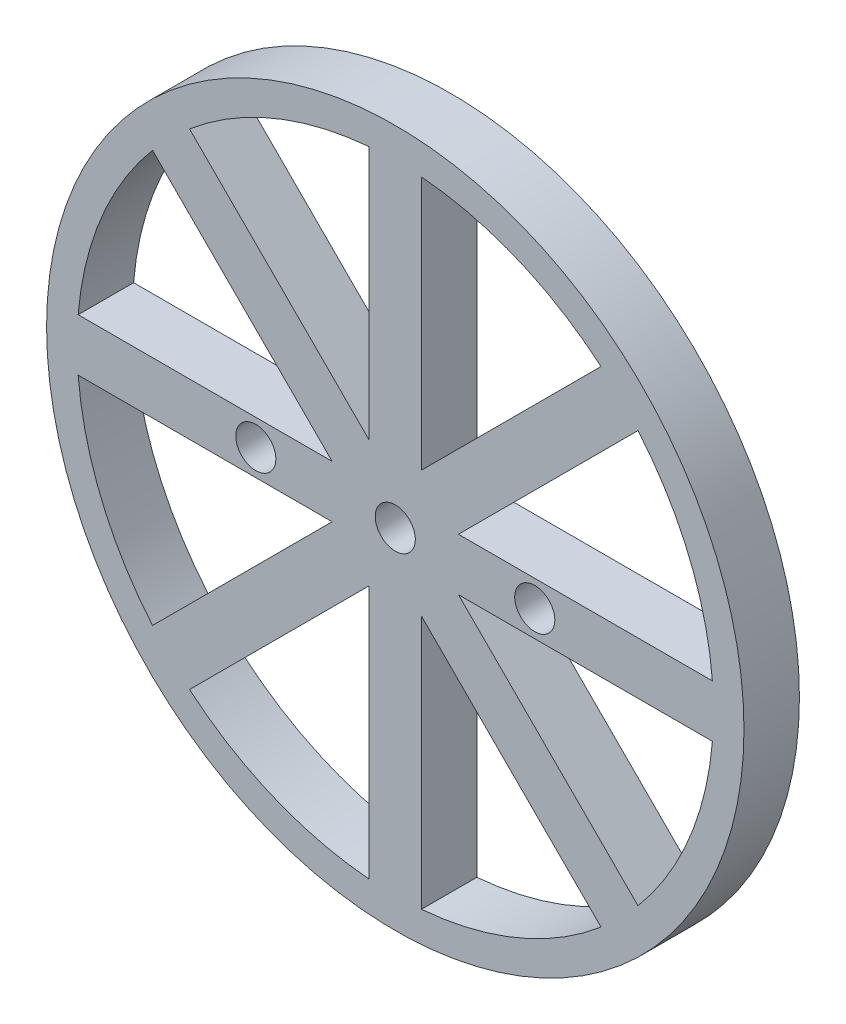
ISO-10303-21;
HEADER;
FILE_DESCRIPTION(('STEP AP214'),'2;1');
FILE_NAME('part.step','',(''),(''),'','','');
FILE_SCHEMA(('AUTOMOTIVE_DESIGN { 1 0 10303 214 1 1 1 1 }'));
ENDSEC;
DATA;
#1=APPLICATION_CONTEXT('core data for automotive mechanical design processes');
#2=APPLICATION_PROTOCOL_DEFINITION('international standard','automotive_design',2000,#1);
#3=PRODUCT_CONTEXT('',#1,'mechanical');
#4=PRODUCT('Part','Part','',(#3));
#5=PRODUCT_RELATED_PRODUCT_CATEGORY('part','',(#4));
#6=PRODUCT_DEFINITION_FORMATION('','',#4);
#7=PRODUCT_DEFINITION_CONTEXT('part definition',#1,'design');
#8=PRODUCT_DEFINITION('design','',#6,#7);
#9=PRODUCT_DEFINITION_SHAPE('','',#8);
#10=(LENGTH_UNIT() NAMED_UNIT(*) SI_UNIT(.MILLI.,.METRE.));
#11=(NAMED_UNIT(*) PLANE_ANGLE_UNIT() SI_UNIT($,.RADIAN.));
#12=(NAMED_UNIT(*) SI_UNIT($,.STERADIAN.) SOLID_ANGLE_UNIT());
#13=UNCERTAINTY_MEASURE_WITH_UNIT(LENGTH_MEASURE(1.E-05),#10,'distance_accuracy_value','');
#14=(GEOMETRIC_REPRESENTATION_CONTEXT(3) GLOBAL_UNCERTAINTY_ASSIGNED_CONTEXT((#13)) GLOBAL_UNIT_ASSIGNED_CONTEXT((#10,
#11,#12)) REPRESENTATION_CONTEXT('',''));
#15=CARTESIAN_POINT('',(0.,0.,0.));
#16=DIRECTION('',(0.,0.,1.));
#17=DIRECTION('',(1.,0.,0.));
#18=AXIS2_PLACEMENT_3D('',#15,#16,#17);
#19=CARTESIAN_POINT('',(0.,0.,3.18));
#20=DIRECTION('',(0.,0.,1.));
#21=DIRECTION('',(1.,0.,0.));
#22=AXIS2_PLACEMENT_3D('',#19,#20,#21);
#23=PLANE('',#22);
#24=DIRECTION('',(0.,-1.,0.));
#25=VECTOR('',#24,1.);
#26=CARTESIAN_POINT('',(1.5,18.1882517026788,3.18));
#27=LINE('',#26,#25);
#28=CARTESIAN_POINT('',(1.5,18.1882517026788,3.18));
#29=VERTEX_POINT('',#28);
#30=CARTESIAN_POINT('',(1.5,3.62132034355965,3.18));
#31=VERTEX_POINT('',#30);
#32=EDGE_CURVE('E314',#29,#31,#27,.T.);
#33=ORIENTED_EDGE('',*,*,#32,.F.);
#34=CARTESIAN_POINT('',(0.,0.,3.18));
#35=DIRECTION('',(0.,0.,1.));
#36=DIRECTION('',(1.,0.,0.));
#37=AXIS2_PLACEMENT_3D('',#34,#35,#36);
#38=CIRCLE('',#37,18.25);
#39=CARTESIAN_POINT('',(11.8003759451121,13.9216962886718,3.18));
#40=VERTEX_POINT('',#39);
#41=EDGE_CURVE('E311',#40,#29,#38,.T.);
#42=ORIENTED_EDGE('',*,*,#41,.F.);
#43=DIRECTION('',(0.707106781186546,0.707106781186549,0.));
#44=VECTOR('',#43,1.);
#45=CARTESIAN_POINT('',(11.8003759451121,13.9216962886718,3.18));
#46=LINE('',#45,#44);
#47=EDGE_CURVE('E319',#31,#40,#46,.T.);
#48=ORIENTED_EDGE('',*,*,#47,.F.);
#49=EDGE_LOOP('',(#33,#42,#48));
#50=FACE_BOUND('',#49,.T.);
#51=DIRECTION('',(0.,-1.,0.));
#52=VECTOR('',#51,1.);
#53=CARTESIAN_POINT('',(1.5,-3.62132034355955,3.18));
#54=LINE('',#53,#52);
#55=CARTESIAN_POINT('',(1.5,-3.62132034355955,3.18));
#56=VERTEX_POINT('',#55);
#57=CARTESIAN_POINT('',(1.5,-18.1882517026788,3.18));
#58=VERTEX_POINT('',#57);
#59=EDGE_CURVE('E347',#56,#58,#54,.T.);
#60=ORIENTED_EDGE('',*,*,#59,.F.);
#61=DIRECTION('',(-0.707106781186543,0.707106781186552,0.));
#62=VECTOR('',#61,1.);
#63=CARTESIAN_POINT('',(1.5,-3.62132034355955,3.18));
#64=LINE('',#63,#62);
#65=CARTESIAN_POINT('',(11.8003759451121,-13.9216962886718,3.18));
#66=VERTEX_POINT('',#65);
#67=EDGE_CURVE('E344',#66,#56,#64,.T.);
#68=ORIENTED_EDGE('',*,*,#67,.F.);
#69=CARTESIAN_POINT('',(0.,0.,3.18));
#70=DIRECTION('',(0.,0.,1.));
#71=DIRECTION('',(1.,0.,0.));
#72=AXIS2_PLACEMENT_3D('',#69,#70,#71);
#73=CIRCLE('',#72,18.25);
#74=EDGE_CURVE('E352',#58,#66,#73,.T.);
#75=ORIENTED_EDGE('',*,*,#74,.F.);
#76=EDGE_LOOP('',(#60,#68,#75));
#77=FACE_BOUND('',#76,.T.);
#78=CARTESIAN_POINT('',(0.,0.,3.18));
#79=DIRECTION('',(0.,0.,1.));
#80=DIRECTION('',(1.,0.,0.));
#81=AXIS2_PLACEMENT_3D('',#78,#79,#80);
#82=CIRCLE('',#81,18.25);
#83=CARTESIAN_POINT('',(13.9216962886718,-11.8003759451122,3.18));
#84=VERTEX_POINT('',#83);
#85=CARTESIAN_POINT('',(18.1882517026788,-1.5,3.18));
#86=VERTEX_POINT('',#85);
#87=EDGE_CURVE('E380',#84,#86,#82,.T.);
#88=ORIENTED_EDGE('',*,*,#87,.F.);
#89=DIRECTION('',(0.707106781186548,-0.707106781186547,0.));
#90=VECTOR('',#89,1.);
#91=CARTESIAN_POINT('',(3.62132034355959,-1.5,3.18));
#92=LINE('',#91,#90);
#93=CARTESIAN_POINT('',(3.62132034355959,-1.5,3.18));
#94=VERTEX_POINT('',#93);
#95=EDGE_CURVE('E377',#94,#84,#92,.T.);
#96=ORIENTED_EDGE('',*,*,#95,.F.);
#97=DIRECTION('',(-1.,0.,0.));
#98=VECTOR('',#97,1.);
#99=CARTESIAN_POINT('',(3.62132034355959,-1.5,3.18));
#100=LINE('',#99,#98);
#101=EDGE_CURVE('E385',#86,#94,#100,.T.);
#102=ORIENTED_EDGE('',*,*,#101,.F.);
#103=EDGE_LOOP('',(#88,#96,#102));
#104=FACE_BOUND('',#103,.T.);
#105=DIRECTION('',(0.,1.,0.));
#106=VECTOR('',#105,1.);
#107=CARTESIAN_POINT('',(-1.5,-3.6213203435595,3.18));
#108=LINE('',#107,#106);
#109=CARTESIAN_POINT('',(-1.5,-18.1882517026788,3.18));
#110=VERTEX_POINT('',#109);
#111=CARTESIAN_POINT('',(-1.5,-3.6213203435595,3.18));
#112=VERTEX_POINT('',#111);
#113=EDGE_CURVE('E413',#110,#112,#108,.T.);
#114=ORIENTED_EDGE('',*,*,#113,.F.);
#115=CARTESIAN_POINT('',(0.,0.,3.18));
#116=DIRECTION('',(0.,0.,1.));
#117=DIRECTION('',(1.,0.,0.));
#118=AXIS2_PLACEMENT_3D('',#115,#116,#117);
#119=CIRCLE('',#118,18.25);
#120=CARTESIAN_POINT('',(-11.8003759451121,-13.9216962886718,3.18));
#121=VERTEX_POINT('',#120);
#122=EDGE_CURVE('E410',#121,#110,#119,.T.);
#123=ORIENTED_EDGE('',*,*,#122,.F.);
#124=DIRECTION('',(-0.707106781186541,-0.707106781186554,0.));
#125=VECTOR('',#124,1.);
#126=CARTESIAN_POINT('',(-1.5,-3.6213203435595,3.18));
#127=LINE('',#126,#125);
#128=EDGE_CURVE('E418',#112,#121,#127,.T.);
#129=ORIENTED_EDGE('',*,*,#128,.F.);
#130=EDGE_LOOP('',(#114,#123,#129));
#131=FACE_BOUND('',#130,.T.);
#132=DIRECTION('',(0.707106781186545,-0.707106781186549,0.));
#133=VECTOR('',#132,1.);
#134=CARTESIAN_POINT('',(-11.8003759451121,13.9216962886718,3.18));
#135=LINE('',#134,#133);
#136=CARTESIAN_POINT('',(-11.8003759451121,13.9216962886718,3.18));
#137=VERTEX_POINT('',#136);
#138=CARTESIAN_POINT('',(-1.5,3.62132034355962,3.18));
#139=VERTEX_POINT('',#138);
#140=EDGE_CURVE('E446',#137,#139,#135,.T.);
#141=ORIENTED_EDGE('',*,*,#140,.F.);
#142=CARTESIAN_POINT('',(0.,0.,3.18));
#143=DIRECTION('',(0.,0.,1.));
#144=DIRECTION('',(1.,0.,0.));
#145=AXIS2_PLACEMENT_3D('',#142,#143,#144);
#146=CIRCLE('',#145,18.25);
#147=CARTESIAN_POINT('',(-1.5,18.1882517026788,3.18));
#148=VERTEX_POINT('',#147);
#149=EDGE_CURVE('E443',#148,#137,#146,.T.);
#150=ORIENTED_EDGE('',*,*,#149,.F.);
#151=DIRECTION('',(0.,1.,0.));
#152=VECTOR('',#151,1.);
#153=CARTESIAN_POINT('',(-1.5,18.1882517026788,3.18));
#154=LINE('',#153,#152);
#155=EDGE_CURVE('E451',#139,#148,#154,.T.);
#156=ORIENTED_EDGE('',*,*,#155,.F.);
#157=EDGE_LOOP('',(#141,#150,#156));
#158=FACE_BOUND('',#157,.T.);
#159=CARTESIAN_POINT('',(-8.,0.,3.18));
#160=DIRECTION('',(0.,0.,1.));
#161=DIRECTION('',(1.,0.,0.));
#162=AXIS2_PLACEMENT_3D('',#159,#160,#161);
#163=CIRCLE('',#162,1.15);
#164=CARTESIAN_POINT('',(-6.85,0.,3.18));
#165=VERTEX_POINT('',#164);
#166=EDGE_CURVE('E476',#165,#165,#163,.T.);
#167=ORIENTED_EDGE('',*,*,#166,.F.);
#168=EDGE_LOOP('',(#167));
#169=FACE_BOUND('',#168,.T.);
#170=CARTESIAN_POINT('',(0.,0.,3.18));
#171=DIRECTION('',(0.,0.,1.));
#172=DIRECTION('',(1.,0.,0.));
#173=AXIS2_PLACEMENT_3D('',#170,#171,#172);
#174=CIRCLE('',#173,20.);
#175=CARTESIAN_POINT('',(20.,0.,3.18));
#176=VERTEX_POINT('',#175);
#177=EDGE_CURVE('E11',#176,#176,#174,.T.);
#178=ORIENTED_EDGE('',*,*,#177,.T.);
#179=EDGE_LOOP('',(#178));
#180=FACE_BOUND('',#179,.T.);
#181=CARTESIAN_POINT('',(0.,0.,3.18));
#182=DIRECTION('',(0.,0.,1.));
#183=DIRECTION('',(1.,0.,0.));
#184=AXIS2_PLACEMENT_3D('',#181,#182,#183);
#185=CIRCLE('',#184,1.15);
#186=CARTESIAN_POINT('',(1.15,0.,3.18));
#187=VERTEX_POINT('',#186);
#188=EDGE_CURVE('E484',#187,#187,#185,.T.);
#189=ORIENTED_EDGE('',*,*,#188,.F.);
#190=EDGE_LOOP('',(#189));
#191=FACE_BOUND('',#190,.T.);
#192=CARTESIAN_POINT('',(8.,0.,3.18));
#193=DIRECTION('',(0.,0.,1.));
#194=DIRECTION('',(1.,0.,0.));
#195=AXIS2_PLACEMENT_3D('',#192,#193,#194);
#196=CIRCLE('',#195,1.15);
#197=CARTESIAN_POINT('',(9.15,0.,3.18));
#198=VERTEX_POINT('',#197);
#199=EDGE_CURVE('E303',#198,#198,#196,.T.);
#200=ORIENTED_EDGE('',*,*,#199,.F.);
#201=EDGE_LOOP('',(#200));
#202=FACE_BOUND('',#201,.T.);
#203=DIRECTION('',(1.,0.,0.));
#204=VECTOR('',#203,1.);
#205=CARTESIAN_POINT('',(-18.1882517026788,1.5,3.18));
#206=LINE('',#205,#204);
#207=CARTESIAN_POINT('',(-18.1882517026788,1.5,3.18));
#208=VERTEX_POINT('',#207);
#209=CARTESIAN_POINT('',(-3.62132034355955,1.5,3.18));
#210=VERTEX_POINT('',#209);
#211=EDGE_CURVE('E273',#208,#210,#206,.T.);
#212=ORIENTED_EDGE('',*,*,#211,.F.);
#213=CARTESIAN_POINT('',(0.,0.,3.18));
#214=DIRECTION('',(0.,0.,1.));
#215=DIRECTION('',(1.,0.,0.));
#216=AXIS2_PLACEMENT_3D('',#213,#214,#215);
#217=CIRCLE('',#216,18.25);
#218=CARTESIAN_POINT('',(-13.9216962886718,11.8003759451122,3.18));
#219=VERTEX_POINT('',#218);
#220=EDGE_CURVE('E270',#219,#208,#217,.T.);
#221=ORIENTED_EDGE('',*,*,#220,.F.);
#222=DIRECTION('',(-0.707106781186549,0.707106781186546,0.));
#223=VECTOR('',#222,1.);
#224=CARTESIAN_POINT('',(-13.9216962886718,11.8003759451122,3.18));
#225=LINE('',#224,#223);
#226=EDGE_CURVE('E278',#210,#219,#225,.T.);
#227=ORIENTED_EDGE('',*,*,#226,.F.);
#228=EDGE_LOOP('',(#212,#221,#227));
#229=FACE_BOUND('',#228,.T.);
#230=DIRECTION('',(-0.707106781186548,-0.707106781186547,0.));
#231=VECTOR('',#230,1.);
#232=CARTESIAN_POINT('',(13.9216962886718,11.8003759451122,3.18));
#233=LINE('',#232,#231);
#234=CARTESIAN_POINT('',(13.9216962886718,11.8003759451122,3.18));
#235=VERTEX_POINT('',#234);
#236=CARTESIAN_POINT('',(3.6213203435596,1.5,3.18));
#237=VERTEX_POINT('',#236);
#238=EDGE_CURVE('E240',#235,#237,#233,.T.);
#239=ORIENTED_EDGE('',*,*,#238,.F.);
#240=CARTESIAN_POINT('',(0.,0.,3.18));
#241=DIRECTION('',(0.,0.,1.));
#242=DIRECTION('',(1.,0.,0.));
#243=AXIS2_PLACEMENT_3D('',#240,#241,#242);
#244=CIRCLE('',#243,18.25);
#245=CARTESIAN_POINT('',(18.1882517026788,1.5,3.18));
#246=VERTEX_POINT('',#245);
#247=EDGE_CURVE('E237',#246,#235,#244,.T.);
#248=ORIENTED_EDGE('',*,*,#247,.F.);
#249=DIRECTION('',(1.,0.,0.));
#250=VECTOR('',#249,1.);
#251=CARTESIAN_POINT('',(3.6213203435596,1.5,3.18));
#252=LINE('',#251,#250);
#253=EDGE_CURVE('E245',#237,#246,#252,.T.);
#254=ORIENTED_EDGE('',*,*,#253,.F.);
#255=EDGE_LOOP('',(#239,#248,#254));
#256=FACE_BOUND('',#255,.T.);
#257=DIRECTION('',(0.707106781186547,0.707106781186548,0.));
#258=VECTOR('',#257,1.);
#259=CARTESIAN_POINT('',(-3.62132034355963,-1.5,3.18));
#260=LINE('',#259,#258);
#261=CARTESIAN_POINT('',(-13.9216962886718,-11.8003759451122,3.18));
#262=VERTEX_POINT('',#261);
#263=CARTESIAN_POINT('',(-3.62132034355963,-1.5,3.18));
#264=VERTEX_POINT('',#263);
#265=EDGE_CURVE('E210',#262,#264,#260,.T.);
#266=ORIENTED_EDGE('',*,*,#265,.F.);
#267=CARTESIAN_POINT('',(0.,0.,3.18));
#268=DIRECTION('',(0.,0.,1.));
#269=DIRECTION('',(1.,0.,0.));
#270=AXIS2_PLACEMENT_3D('',#267,#268,#269);
#271=CIRCLE('',#270,18.25);
#272=CARTESIAN_POINT('',(-18.1882517026788,-1.5,3.18));
#273=VERTEX_POINT('',#272);
#274=EDGE_CURVE('E201',#273,#262,#271,.T.);
#275=ORIENTED_EDGE('',*,*,#274,.F.);
#276=DIRECTION('',(-1.,0.,0.));
#277=VECTOR('',#276,1.);
#278=CARTESIAN_POINT('',(-18.1882517026788,-1.5,3.18));
#279=LINE('',#278,#277);
#280=EDGE_CURVE('E220',#264,#273,#279,.T.);
#281=ORIENTED_EDGE('',*,*,#280,.F.);
#282=EDGE_LOOP('',(#266,#275,#281));
#283=FACE_BOUND('',#282,.T.);
#284=ADVANCED_FACE('F39',(#50,#77,#104,#131,#158,#169,#180,#191,#202,#229,#256,#283),#23,.T.);
#285=CARTESIAN_POINT('',(0.,0.,0.));
#286=DIRECTION('',(0.,0.,1.));
#287=DIRECTION('',(1.,0.,0.));
#288=AXIS2_PLACEMENT_3D('',#285,#286,#287);
#289=PLANE('',#288);
#290=CARTESIAN_POINT('',(0.,0.,0.));
#291=DIRECTION('',(0.,0.,1.));
#292=DIRECTION('',(1.,0.,0.));
#293=AXIS2_PLACEMENT_3D('',#290,#291,#292);
#294=CIRCLE('',#293,18.25);
#295=CARTESIAN_POINT('',(18.1882517026788,1.5,0.));
#296=VERTEX_POINT('',#295);
#297=CARTESIAN_POINT('',(13.9216962886718,11.8003759451122,0.));
#298=VERTEX_POINT('',#297);
#299=EDGE_CURVE('E218',#296,#298,#294,.T.);
#300=ORIENTED_EDGE('',*,*,#299,.T.);
#301=DIRECTION('',(-0.707106781186548,-0.707106781186547,0.));
#302=VECTOR('',#301,1.);
#303=CARTESIAN_POINT('',(13.9216962886718,11.8003759451122,0.));
#304=LINE('',#303,#302);
#305=CARTESIAN_POINT('',(3.6213203435596,1.5,0.));
#306=VERTEX_POINT('',#305);
#307=EDGE_CURVE('E252',#298,#306,#304,.T.);
#308=ORIENTED_EDGE('',*,*,#307,.T.);
#309=DIRECTION('',(1.,0.,0.));
#310=VECTOR('',#309,1.);
#311=CARTESIAN_POINT('',(3.6213203435596,1.5,0.));
#312=LINE('',#311,#310);
#313=EDGE_CURVE('E241',#306,#296,#312,.T.);
#314=ORIENTED_EDGE('',*,*,#313,.T.);
#315=EDGE_LOOP('',(#300,#308,#314));
#316=FACE_BOUND('',#315,.T.);
#317=CARTESIAN_POINT('',(8.,0.,0.));
#318=DIRECTION('',(0.,0.,1.));
#319=DIRECTION('',(1.,0.,0.));
#320=AXIS2_PLACEMENT_3D('',#317,#318,#319);
#321=CIRCLE('',#320,1.15);
#322=CARTESIAN_POINT('',(9.15,0.,0.));
#323=VERTEX_POINT('',#322);
#324=EDGE_CURVE('E302',#323,#323,#321,.T.);
#325=ORIENTED_EDGE('',*,*,#324,.T.);
#326=EDGE_LOOP('',(#325));
#327=FACE_BOUND('',#326,.T.);
#328=CARTESIAN_POINT('',(0.,0.,0.));
#329=DIRECTION('',(0.,0.,1.));
#330=DIRECTION('',(1.,0.,0.));
#331=AXIS2_PLACEMENT_3D('',#328,#329,#330);
#332=CIRCLE('',#331,18.25);
#333=CARTESIAN_POINT('',(11.8003759451121,13.9216962886718,0.));
#334=VERTEX_POINT('',#333);
#335=CARTESIAN_POINT('',(1.5,18.1882517026788,0.));
#336=VERTEX_POINT('',#335);
#337=EDGE_CURVE('E307',#334,#336,#332,.T.);
#338=ORIENTED_EDGE('',*,*,#337,.T.);
#339=DIRECTION('',(0.,-1.,0.));
#340=VECTOR('',#339,1.);
#341=CARTESIAN_POINT('',(1.5,18.1882517026788,0.));
#342=LINE('',#341,#340);
#343=CARTESIAN_POINT('',(1.5,3.62132034355965,0.));
#344=VERTEX_POINT('',#343);
#345=EDGE_CURVE('E326',#336,#344,#342,.T.);
#346=ORIENTED_EDGE('',*,*,#345,.T.);
#347=DIRECTION('',(0.707106781186546,0.707106781186549,0.));
#348=VECTOR('',#347,1.);
#349=CARTESIAN_POINT('',(11.8003759451121,13.9216962886718,0.));
#350=LINE('',#349,#348);
#351=EDGE_CURVE('E315',#344,#334,#350,.T.);
#352=ORIENTED_EDGE('',*,*,#351,.T.);
#353=EDGE_LOOP('',(#338,#346,#352));
#354=FACE_BOUND('',#353,.T.);
#355=DIRECTION('',(0.707106781186548,-0.707106781186547,0.));
#356=VECTOR('',#355,1.);
#357=CARTESIAN_POINT('',(3.62132034355959,-1.5,0.));
#358=LINE('',#357,#356);
#359=CARTESIAN_POINT('',(3.62132034355959,-1.5,0.));
#360=VERTEX_POINT('',#359);
#361=CARTESIAN_POINT('',(13.9216962886718,-11.8003759451122,0.));
#362=VERTEX_POINT('',#361);
#363=EDGE_CURVE('E376',#360,#362,#358,.T.);
#364=ORIENTED_EDGE('',*,*,#363,.T.);
#365=CARTESIAN_POINT('',(0.,0.,0.));
#366=DIRECTION('',(0.,0.,1.));
#367=DIRECTION('',(1.,0.,0.));
#368=AXIS2_PLACEMENT_3D('',#365,#366,#367);
#369=CIRCLE('',#368,18.25);
#370=CARTESIAN_POINT('',(18.1882517026788,-1.5,0.));
#371=VERTEX_POINT('',#370);
#372=EDGE_CURVE('E392',#362,#371,#369,.T.);
#373=ORIENTED_EDGE('',*,*,#372,.T.);
#374=DIRECTION('',(-1.,0.,0.));
#375=VECTOR('',#374,1.);
#376=CARTESIAN_POINT('',(3.62132034355959,-1.5,0.));
#377=LINE('',#376,#375);
#378=EDGE_CURVE('E381',#371,#360,#377,.T.);
#379=ORIENTED_EDGE('',*,*,#378,.T.);
#380=EDGE_LOOP('',(#364,#373,#379));
#381=FACE_BOUND('',#380,.T.);
#382=CARTESIAN_POINT('',(0.,0.,0.));
#383=DIRECTION('',(0.,0.,1.));
#384=DIRECTION('',(1.,0.,0.));
#385=AXIS2_PLACEMENT_3D('',#382,#383,#384);
#386=CIRCLE('',#385,18.25);
#387=CARTESIAN_POINT('',(-1.5,18.1882517026788,0.));
#388=VERTEX_POINT('',#387);
#389=CARTESIAN_POINT('',(-11.8003759451121,13.9216962886718,0.));
#390=VERTEX_POINT('',#389);
#391=EDGE_CURVE('E442',#388,#390,#386,.T.);
#392=ORIENTED_EDGE('',*,*,#391,.T.);
#393=DIRECTION('',(0.707106781186545,-0.707106781186549,0.));
#394=VECTOR('',#393,1.);
#395=CARTESIAN_POINT('',(-11.8003759451121,13.9216962886718,0.));
#396=LINE('',#395,#394);
#397=CARTESIAN_POINT('',(-1.5,3.62132034355962,0.));
#398=VERTEX_POINT('',#397);
#399=EDGE_CURVE('E458',#390,#398,#396,.T.);
#400=ORIENTED_EDGE('',*,*,#399,.T.);
#401=DIRECTION('',(0.,1.,0.));
#402=VECTOR('',#401,1.);
#403=CARTESIAN_POINT('',(-1.5,18.1882517026788,0.));
#404=LINE('',#403,#402);
#405=EDGE_CURVE('E447',#398,#388,#404,.T.);
#406=ORIENTED_EDGE('',*,*,#405,.T.);
#407=EDGE_LOOP('',(#392,#400,#406));
#408=FACE_BOUND('',#407,.T.);
#409=CARTESIAN_POINT('',(0.,0.,0.));
#410=DIRECTION('',(0.,0.,1.));
#411=DIRECTION('',(1.,0.,0.));
#412=AXIS2_PLACEMENT_3D('',#409,#410,#411);
#413=CIRCLE('',#412,20.);
#414=CARTESIAN_POINT('',(20.,0.,0.));
#415=VERTEX_POINT('',#414);
#416=EDGE_CURVE('E43',#415,#415,#413,.T.);
#417=ORIENTED_EDGE('',*,*,#416,.F.);
#418=EDGE_LOOP('',(#417));
#419=FACE_BOUND('',#418,.T.);
#420=CARTESIAN_POINT('',(0.,0.,0.));
#421=DIRECTION('',(0.,0.,1.));
#422=DIRECTION('',(1.,0.,0.));
#423=AXIS2_PLACEMENT_3D('',#420,#421,#422);
#424=CIRCLE('',#423,1.15);
#425=CARTESIAN_POINT('',(1.15,0.,0.));
#426=VERTEX_POINT('',#425);
#427=EDGE_CURVE('E480',#426,#426,#424,.T.);
#428=ORIENTED_EDGE('',*,*,#427,.T.);
#429=EDGE_LOOP('',(#428));
#430=FACE_BOUND('',#429,.T.);
#431=CARTESIAN_POINT('',(-8.,0.,0.));
#432=DIRECTION('',(0.,0.,1.));
#433=DIRECTION('',(1.,0.,0.));
#434=AXIS2_PLACEMENT_3D('',#431,#432,#433);
#435=CIRCLE('',#434,1.15);
#436=CARTESIAN_POINT('',(-6.85,0.,0.));
#437=VERTEX_POINT('',#436);
#438=EDGE_CURVE('E475',#437,#437,#435,.T.);
#439=ORIENTED_EDGE('',*,*,#438,.T.);
#440=EDGE_LOOP('',(#439));
#441=FACE_BOUND('',#440,.T.);
#442=CARTESIAN_POINT('',(0.,0.,0.));
#443=DIRECTION('',(0.,0.,1.));
#444=DIRECTION('',(1.,0.,0.));
#445=AXIS2_PLACEMENT_3D('',#442,#443,#444);
#446=CIRCLE('',#445,18.25);
#447=CARTESIAN_POINT('',(-11.8003759451121,-13.9216962886718,0.));
#448=VERTEX_POINT('',#447);
#449=CARTESIAN_POINT('',(-1.5,-18.1882517026788,0.));
#450=VERTEX_POINT('',#449);
#451=EDGE_CURVE('E409',#448,#450,#446,.T.);
#452=ORIENTED_EDGE('',*,*,#451,.T.);
#453=DIRECTION('',(0.,1.,0.));
#454=VECTOR('',#453,1.);
#455=CARTESIAN_POINT('',(-1.5,-3.6213203435595,0.));
#456=LINE('',#455,#454);
#457=CARTESIAN_POINT('',(-1.5,-3.6213203435595,0.));
#458=VERTEX_POINT('',#457);
#459=EDGE_CURVE('E425',#450,#458,#456,.T.);
#460=ORIENTED_EDGE('',*,*,#459,.T.);
#461=DIRECTION('',(-0.707106781186541,-0.707106781186554,0.));
#462=VECTOR('',#461,1.);
#463=CARTESIAN_POINT('',(-1.5,-3.6213203435595,0.));
#464=LINE('',#463,#462);
#465=EDGE_CURVE('E414',#458,#448,#464,.T.);
#466=ORIENTED_EDGE('',*,*,#465,.T.);
#467=EDGE_LOOP('',(#452,#460,#466));
#468=FACE_BOUND('',#467,.T.);
#469=DIRECTION('',(-0.707106781186543,0.707106781186552,0.));
#470=VECTOR('',#469,1.);
#471=CARTESIAN_POINT('',(1.5,-3.62132034355955,0.));
#472=LINE('',#471,#470);
#473=CARTESIAN_POINT('',(11.8003759451121,-13.9216962886718,0.));
#474=VERTEX_POINT('',#473);
#475=CARTESIAN_POINT('',(1.5,-3.62132034355955,0.));
#476=VERTEX_POINT('',#475);
#477=EDGE_CURVE('E343',#474,#476,#472,.T.);
#478=ORIENTED_EDGE('',*,*,#477,.T.);
#479=DIRECTION('',(0.,-1.,0.));
#480=VECTOR('',#479,1.);
#481=CARTESIAN_POINT('',(1.5,-3.62132034355955,0.));
#482=LINE('',#481,#480);
#483=CARTESIAN_POINT('',(1.5,-18.1882517026788,0.));
#484=VERTEX_POINT('',#483);
#485=EDGE_CURVE('E359',#476,#484,#482,.T.);
#486=ORIENTED_EDGE('',*,*,#485,.T.);
#487=CARTESIAN_POINT('',(0.,0.,0.));
#488=DIRECTION('',(0.,0.,1.));
#489=DIRECTION('',(1.,0.,0.));
#490=AXIS2_PLACEMENT_3D('',#487,#488,#489);
#491=CIRCLE('',#490,18.25);
#492=EDGE_CURVE('E348',#484,#474,#491,.T.);
#493=ORIENTED_EDGE('',*,*,#492,.T.);
#494=EDGE_LOOP('',(#478,#486,#493));
#495=FACE_BOUND('',#494,.T.);
#496=CARTESIAN_POINT('',(0.,0.,0.));
#497=DIRECTION('',(0.,0.,1.));
#498=DIRECTION('',(1.,0.,0.));
#499=AXIS2_PLACEMENT_3D('',#496,#497,#498);
#500=CIRCLE('',#499,18.25);
#501=CARTESIAN_POINT('',(-13.9216962886718,11.8003759451122,0.));
#502=VERTEX_POINT('',#501);
#503=CARTESIAN_POINT('',(-18.1882517026788,1.5,0.));
#504=VERTEX_POINT('',#503);
#505=EDGE_CURVE('E269',#502,#504,#500,.T.);
#506=ORIENTED_EDGE('',*,*,#505,.T.);
#507=DIRECTION('',(1.,0.,0.));
#508=VECTOR('',#507,1.);
#509=CARTESIAN_POINT('',(-18.1882517026788,1.5,0.));
#510=LINE('',#509,#508);
#511=CARTESIAN_POINT('',(-3.62132034355955,1.5,0.));
#512=VERTEX_POINT('',#511);
#513=EDGE_CURVE('E285',#504,#512,#510,.T.);
#514=ORIENTED_EDGE('',*,*,#513,.T.);
#515=DIRECTION('',(-0.707106781186549,0.707106781186546,0.));
#516=VECTOR('',#515,1.);
#517=CARTESIAN_POINT('',(-13.9216962886718,11.8003759451122,0.));
#518=LINE('',#517,#516);
#519=EDGE_CURVE('E274',#512,#502,#518,.T.);
#520=ORIENTED_EDGE('',*,*,#519,.T.);
#521=EDGE_LOOP('',(#506,#514,#520));
#522=FACE_BOUND('',#521,.T.);
#523=CARTESIAN_POINT('',(0.,0.,0.));
#524=DIRECTION('',(0.,0.,1.));
#525=DIRECTION('',(1.,0.,0.));
#526=AXIS2_PLACEMENT_3D('',#523,#524,#525);
#527=CIRCLE('',#526,18.25);
#528=CARTESIAN_POINT('',(-18.1882517026788,-1.5,0.));
#529=VERTEX_POINT('',#528);
#530=CARTESIAN_POINT('',(-13.9216962886718,-11.8003759451122,0.));
#531=VERTEX_POINT('',#530);
#532=EDGE_CURVE('E63',#529,#531,#527,.T.);
#533=ORIENTED_EDGE('',*,*,#532,.T.);
#534=DIRECTION('',(0.707106781186547,0.707106781186548,0.));
#535=VECTOR('',#534,1.);
#536=CARTESIAN_POINT('',(-3.62132034355963,-1.5,0.));
#537=LINE('',#536,#535);
#538=CARTESIAN_POINT('',(-3.62132034355963,-1.5,0.));
#539=VERTEX_POINT('',#538);
#540=EDGE_CURVE('E216',#531,#539,#537,.T.);
#541=ORIENTED_EDGE('',*,*,#540,.T.);
#542=DIRECTION('',(-1.,0.,0.));
#543=VECTOR('',#542,1.);
#544=CARTESIAN_POINT('',(-18.1882517026788,-1.5,0.));
#545=LINE('',#544,#543);
#546=EDGE_CURVE('E211',#539,#529,#545,.T.);
#547=ORIENTED_EDGE('',*,*,#546,.T.);
#548=EDGE_LOOP('',(#533,#541,#547));
#549=FACE_BOUND('',#548,.T.);
#550=ADVANCED_FACE('F492',(#316,#327,#354,#381,#408,#419,#430,#441,#468,#495,#522,#549),#289,.F.);
#551=CARTESIAN_POINT('',(0.,0.,3.18));
#552=DIRECTION('',(0.,0.,-1.));
#553=DIRECTION('',(-1.,0.,0.));
#554=AXIS2_PLACEMENT_3D('',#551,#552,#553);
#555=CYLINDRICAL_SURFACE('',#554,20.);
#556=ORIENTED_EDGE('',*,*,#177,.F.);
#557=EDGE_LOOP('',(#556));
#558=FACE_BOUND('',#557,.T.);
#559=ORIENTED_EDGE('',*,*,#416,.T.);
#560=EDGE_LOOP('',(#559));
#561=FACE_BOUND('',#560,.T.);
#562=ADVANCED_FACE('F41',(#558,#561),#555,.T.);
#563=CARTESIAN_POINT('',(0.,0.,3.18));
#564=DIRECTION('',(0.,0.,-1.));
#565=DIRECTION('',(-1.,0.,0.));
#566=AXIS2_PLACEMENT_3D('',#563,#564,#565);
#567=CYLINDRICAL_SURFACE('',#566,1.15);
#568=ORIENTED_EDGE('',*,*,#188,.T.);
#569=EDGE_LOOP('',(#568));
#570=FACE_BOUND('',#569,.T.);
#571=ORIENTED_EDGE('',*,*,#427,.F.);
#572=EDGE_LOOP('',(#571));
#573=FACE_BOUND('',#572,.T.);
#574=ADVANCED_FACE('F495',(#570,#573),#567,.F.);
#575=CARTESIAN_POINT('',(-8.,0.,3.18));
#576=DIRECTION('',(0.,0.,-1.));
#577=DIRECTION('',(-1.,0.,0.));
#578=AXIS2_PLACEMENT_3D('',#575,#576,#577);
#579=CYLINDRICAL_SURFACE('',#578,1.15);
#580=ORIENTED_EDGE('',*,*,#166,.T.);
#581=EDGE_LOOP('',(#580));
#582=FACE_BOUND('',#581,.T.);
#583=ORIENTED_EDGE('',*,*,#438,.F.);
#584=EDGE_LOOP('',(#583));
#585=FACE_BOUND('',#584,.T.);
#586=ADVANCED_FACE('F497',(#582,#585),#579,.F.);
#587=CARTESIAN_POINT('',(0.,0.,3.18));
#588=DIRECTION('',(0.,0.,-1.));
#589=DIRECTION('',(-1.,0.,0.));
#590=AXIS2_PLACEMENT_3D('',#587,#588,#589);
#591=CYLINDRICAL_SURFACE('',#590,18.25);
#592=ORIENTED_EDGE('',*,*,#391,.F.);
#593=DIRECTION('',(0.,0.,-1.));
#594=VECTOR('',#593,1.);
#595=CARTESIAN_POINT('',(-1.5,18.1882517026788,3.18));
#596=LINE('',#595,#594);
#597=EDGE_CURVE('E454',#148,#388,#596,.T.);
#598=ORIENTED_EDGE('',*,*,#597,.F.);
#599=ORIENTED_EDGE('',*,*,#149,.T.);
#600=DIRECTION('',(0.,0.,-1.));
#601=VECTOR('',#600,1.);
#602=CARTESIAN_POINT('',(-11.8003759451121,13.9216962886718,3.18));
#603=LINE('',#602,#601);
#604=EDGE_CURVE('E471',#137,#390,#603,.T.);
#605=ORIENTED_EDGE('',*,*,#604,.T.);
#606=EDGE_LOOP('',(#592,#598,#599,#605));
#607=FACE_BOUND('',#606,.T.);
#608=ADVANCED_FACE('F504',(#607),#591,.F.);
#609=CARTESIAN_POINT('',(-11.8003759451121,13.9216962886718,3.18));
#610=DIRECTION('',(0.707106781186549,0.707106781186546,0.));
#611=DIRECTION('',(-0.707106781186546,0.707106781186549,0.));
#612=AXIS2_PLACEMENT_3D('',#609,#610,#611);
#613=PLANE('',#612);
#614=ORIENTED_EDGE('',*,*,#399,.F.);
#615=ORIENTED_EDGE('',*,*,#604,.F.);
#616=ORIENTED_EDGE('',*,*,#140,.T.);
#617=DIRECTION('',(0.,0.,-1.));
#618=VECTOR('',#617,1.);
#619=CARTESIAN_POINT('',(-1.5,3.62132034355962,3.18));
#620=LINE('',#619,#618);
#621=EDGE_CURVE('E468',#139,#398,#620,.T.);
#622=ORIENTED_EDGE('',*,*,#621,.T.);
#623=EDGE_LOOP('',(#614,#615,#616,#622));
#624=FACE_BOUND('',#623,.T.);
#625=ADVANCED_FACE('F639',(#624),#613,.T.);
#626=CARTESIAN_POINT('',(-1.5,18.1882517026788,3.18));
#627=DIRECTION('',(-1.,0.,0.));
#628=DIRECTION('',(0.,-1.,0.));
#629=AXIS2_PLACEMENT_3D('',#626,#627,#628);
#630=PLANE('',#629);
#631=ORIENTED_EDGE('',*,*,#405,.F.);
#632=ORIENTED_EDGE('',*,*,#621,.F.);
#633=ORIENTED_EDGE('',*,*,#155,.T.);
#634=ORIENTED_EDGE('',*,*,#597,.T.);
#635=EDGE_LOOP('',(#631,#632,#633,#634));
#636=FACE_BOUND('',#635,.T.);
#637=ADVANCED_FACE('F635',(#636),#630,.T.);
#638=CARTESIAN_POINT('',(0.,0.,3.18));
#639=DIRECTION('',(0.,0.,-1.));
#640=DIRECTION('',(-1.,0.,0.));
#641=AXIS2_PLACEMENT_3D('',#638,#639,#640);
#642=CYLINDRICAL_SURFACE('',#641,18.25);
#643=ORIENTED_EDGE('',*,*,#451,.F.);
#644=DIRECTION('',(0.,0.,-1.));
#645=VECTOR('',#644,1.);
#646=CARTESIAN_POINT('',(-11.8003759451121,-13.9216962886718,3.18));
#647=LINE('',#646,#645);
#648=EDGE_CURVE('E421',#121,#448,#647,.T.);
#649=ORIENTED_EDGE('',*,*,#648,.F.);
#650=ORIENTED_EDGE('',*,*,#122,.T.);
#651=DIRECTION('',(0.,0.,-1.));
#652=VECTOR('',#651,1.);
#653=CARTESIAN_POINT('',(-1.5,-18.1882517026788,3.18));
#654=LINE('',#653,#652);
#655=EDGE_CURVE('E438',#110,#450,#654,.T.);
#656=ORIENTED_EDGE('',*,*,#655,.T.);
#657=EDGE_LOOP('',(#643,#649,#650,#656));
#658=FACE_BOUND('',#657,.T.);
#659=ADVANCED_FACE('F631',(#658),#642,.F.);
#660=CARTESIAN_POINT('',(-1.5,-3.6213203435595,3.18));
#661=DIRECTION('',(-1.,0.,0.));
#662=DIRECTION('',(0.,0.,1.));
#663=AXIS2_PLACEMENT_3D('',#660,#661,#662);
#664=PLANE('',#663);
#665=ORIENTED_EDGE('',*,*,#459,.F.);
#666=ORIENTED_EDGE('',*,*,#655,.F.);
#667=ORIENTED_EDGE('',*,*,#113,.T.);
#668=DIRECTION('',(0.,0.,-1.));
#669=VECTOR('',#668,1.);
#670=CARTESIAN_POINT('',(-1.5,-3.6213203435595,3.18));
#671=LINE('',#670,#669);
#672=EDGE_CURVE('E435',#112,#458,#671,.T.);
#673=ORIENTED_EDGE('',*,*,#672,.T.);
#674=EDGE_LOOP('',(#665,#666,#667,#673));
#675=FACE_BOUND('',#674,.T.);
#676=ADVANCED_FACE('F627',(#675),#664,.T.);
#677=CARTESIAN_POINT('',(-1.5,-3.6213203435595,3.18));
#678=DIRECTION('',(0.707106781186554,-0.707106781186541,0.));
#679=DIRECTION('',(0.707106781186541,0.707106781186554,0.));
#680=AXIS2_PLACEMENT_3D('',#677,#678,#679);
#681=PLANE('',#680);
#682=ORIENTED_EDGE('',*,*,#465,.F.);
#683=ORIENTED_EDGE('',*,*,#672,.F.);
#684=ORIENTED_EDGE('',*,*,#128,.T.);
#685=ORIENTED_EDGE('',*,*,#648,.T.);
#686=EDGE_LOOP('',(#682,#683,#684,#685));
#687=FACE_BOUND('',#686,.T.);
#688=ADVANCED_FACE('F623',(#687),#681,.T.);
#689=CARTESIAN_POINT('',(3.62132034355959,-1.5,3.18));
#690=DIRECTION('',(0.707106781186547,0.707106781186548,0.));
#691=DIRECTION('',(-0.707106781186548,0.707106781186547,0.));
#692=AXIS2_PLACEMENT_3D('',#689,#690,#691);
#693=PLANE('',#692);
#694=ORIENTED_EDGE('',*,*,#363,.F.);
#695=DIRECTION('',(0.,0.,-1.));
#696=VECTOR('',#695,1.);
#697=CARTESIAN_POINT('',(3.62132034355959,-1.5,3.18));
#698=LINE('',#697,#696);
#699=EDGE_CURVE('E388',#94,#360,#698,.T.);
#700=ORIENTED_EDGE('',*,*,#699,.F.);
#701=ORIENTED_EDGE('',*,*,#95,.T.);
#702=DIRECTION('',(0.,0.,-1.));
#703=VECTOR('',#702,1.);
#704=CARTESIAN_POINT('',(13.9216962886718,-11.8003759451122,3.18));
#705=LINE('',#704,#703);
#706=EDGE_CURVE('E405',#84,#362,#705,.T.);
#707=ORIENTED_EDGE('',*,*,#706,.T.);
#708=EDGE_LOOP('',(#694,#700,#701,#707));
#709=FACE_BOUND('',#708,.T.);
#710=ADVANCED_FACE('F619',(#709),#693,.T.);
#711=CARTESIAN_POINT('',(0.,0.,3.18));
#712=DIRECTION('',(0.,0.,-1.));
#713=DIRECTION('',(-1.,0.,0.));
#714=AXIS2_PLACEMENT_3D('',#711,#712,#713);
#715=CYLINDRICAL_SURFACE('',#714,18.25);
#716=ORIENTED_EDGE('',*,*,#372,.F.);
#717=ORIENTED_EDGE('',*,*,#706,.F.);
#718=ORIENTED_EDGE('',*,*,#87,.T.);
#719=DIRECTION('',(0.,0.,-1.));
#720=VECTOR('',#719,1.);
#721=CARTESIAN_POINT('',(18.1882517026788,-1.5,3.18));
#722=LINE('',#721,#720);
#723=EDGE_CURVE('E402',#86,#371,#722,.T.);
#724=ORIENTED_EDGE('',*,*,#723,.T.);
#725=EDGE_LOOP('',(#716,#717,#718,#724));
#726=FACE_BOUND('',#725,.T.);
#727=ADVANCED_FACE('F615',(#726),#715,.F.);
#728=CARTESIAN_POINT('',(3.62132034355959,-1.5,3.18));
#729=DIRECTION('',(0.,-1.,0.));
#730=DIRECTION('',(1.,0.,0.));
#731=AXIS2_PLACEMENT_3D('',#728,#729,#730);
#732=PLANE('',#731);
#733=ORIENTED_EDGE('',*,*,#378,.F.);
#734=ORIENTED_EDGE('',*,*,#723,.F.);
#735=ORIENTED_EDGE('',*,*,#101,.T.);
#736=ORIENTED_EDGE('',*,*,#699,.T.);
#737=EDGE_LOOP('',(#733,#734,#735,#736));
#738=FACE_BOUND('',#737,.T.);
#739=ADVANCED_FACE('F611',(#738),#732,.T.);
#740=CARTESIAN_POINT('',(1.5,-3.62132034355955,3.18));
#741=DIRECTION('',(-0.707106781186552,-0.707106781186543,0.));
#742=DIRECTION('',(0.707106781186543,-0.707106781186552,0.));
#743=AXIS2_PLACEMENT_3D('',#740,#741,#742);
#744=PLANE('',#743);
#745=ORIENTED_EDGE('',*,*,#477,.F.);
#746=DIRECTION('',(0.,0.,-1.));
#747=VECTOR('',#746,1.);
#748=CARTESIAN_POINT('',(11.8003759451121,-13.9216962886718,3.18));
#749=LINE('',#748,#747);
#750=EDGE_CURVE('E355',#66,#474,#749,.T.);
#751=ORIENTED_EDGE('',*,*,#750,.F.);
#752=ORIENTED_EDGE('',*,*,#67,.T.);
#753=DIRECTION('',(0.,0.,-1.));
#754=VECTOR('',#753,1.);
#755=CARTESIAN_POINT('',(1.5,-3.62132034355955,3.18));
#756=LINE('',#755,#754);
#757=EDGE_CURVE('E372',#56,#476,#756,.T.);
#758=ORIENTED_EDGE('',*,*,#757,.T.);
#759=EDGE_LOOP('',(#745,#751,#752,#758));
#760=FACE_BOUND('',#759,.T.);
#761=ADVANCED_FACE('F607',(#760),#744,.T.);
#762=CARTESIAN_POINT('',(1.5,-3.62132034355955,3.18));
#763=DIRECTION('',(1.,0.,0.));
#764=DIRECTION('',(0.,1.,0.));
#765=AXIS2_PLACEMENT_3D('',#762,#763,#764);
#766=PLANE('',#765);
#767=ORIENTED_EDGE('',*,*,#485,.F.);
#768=ORIENTED_EDGE('',*,*,#757,.F.);
#769=ORIENTED_EDGE('',*,*,#59,.T.);
#770=DIRECTION('',(0.,0.,-1.));
#771=VECTOR('',#770,1.);
#772=CARTESIAN_POINT('',(1.5,-18.1882517026788,3.18));
#773=LINE('',#772,#771);
#774=EDGE_CURVE('E369',#58,#484,#773,.T.);
#775=ORIENTED_EDGE('',*,*,#774,.T.);
#776=EDGE_LOOP('',(#767,#768,#769,#775));
#777=FACE_BOUND('',#776,.T.);
#778=ADVANCED_FACE('F603',(#777),#766,.T.);
#779=CARTESIAN_POINT('',(0.,0.,3.18));
#780=DIRECTION('',(0.,0.,-1.));
#781=DIRECTION('',(-1.,0.,0.));
#782=AXIS2_PLACEMENT_3D('',#779,#780,#781);
#783=CYLINDRICAL_SURFACE('',#782,18.25);
#784=ORIENTED_EDGE('',*,*,#492,.F.);
#785=ORIENTED_EDGE('',*,*,#774,.F.);
#786=ORIENTED_EDGE('',*,*,#74,.T.);
#787=ORIENTED_EDGE('',*,*,#750,.T.);
#788=EDGE_LOOP('',(#784,#785,#786,#787));
#789=FACE_BOUND('',#788,.T.);
#790=ADVANCED_FACE('F599',(#789),#783,.F.);
#791=CARTESIAN_POINT('',(0.,0.,3.18));
#792=DIRECTION('',(0.,0.,-1.));
#793=DIRECTION('',(-1.,0.,0.));
#794=AXIS2_PLACEMENT_3D('',#791,#792,#793);
#795=CYLINDRICAL_SURFACE('',#794,18.25);
#796=ORIENTED_EDGE('',*,*,#337,.F.);
#797=DIRECTION('',(0.,0.,-1.));
#798=VECTOR('',#797,1.);
#799=CARTESIAN_POINT('',(11.8003759451121,13.9216962886718,3.18));
#800=LINE('',#799,#798);
#801=EDGE_CURVE('E322',#40,#334,#800,.T.);
#802=ORIENTED_EDGE('',*,*,#801,.F.);
#803=ORIENTED_EDGE('',*,*,#41,.T.);
#804=DIRECTION('',(0.,0.,-1.));
#805=VECTOR('',#804,1.);
#806=CARTESIAN_POINT('',(1.5,18.1882517026788,3.18));
#807=LINE('',#806,#805);
#808=EDGE_CURVE('E339',#29,#336,#807,.T.);
#809=ORIENTED_EDGE('',*,*,#808,.T.);
#810=EDGE_LOOP('',(#796,#802,#803,#809));
#811=FACE_BOUND('',#810,.T.);
#812=ADVANCED_FACE('F595',(#811),#795,.F.);
#813=CARTESIAN_POINT('',(1.5,18.1882517026788,3.18));
#814=DIRECTION('',(1.,0.,0.));
#815=DIRECTION('',(0.,1.,0.));
#816=AXIS2_PLACEMENT_3D('',#813,#814,#815);
#817=PLANE('',#816);
#818=ORIENTED_EDGE('',*,*,#345,.F.);
#819=ORIENTED_EDGE('',*,*,#808,.F.);
#820=ORIENTED_EDGE('',*,*,#32,.T.);
#821=DIRECTION('',(0.,0.,-1.));
#822=VECTOR('',#821,1.);
#823=CARTESIAN_POINT('',(1.5,3.62132034355965,3.18));
#824=LINE('',#823,#822);
#825=EDGE_CURVE('E336',#31,#344,#824,.T.);
#826=ORIENTED_EDGE('',*,*,#825,.T.);
#827=EDGE_LOOP('',(#818,#819,#820,#826));
#828=FACE_BOUND('',#827,.T.);
#829=ADVANCED_FACE('F591',(#828),#817,.T.);
#830=CARTESIAN_POINT('',(11.8003759451121,13.9216962886718,3.18));
#831=DIRECTION('',(-0.707106781186549,0.707106781186546,0.));
#832=DIRECTION('',(-0.707106781186546,-0.707106781186549,0.));
#833=AXIS2_PLACEMENT_3D('',#830,#831,#832);
#834=PLANE('',#833);
#835=ORIENTED_EDGE('',*,*,#351,.F.);
#836=ORIENTED_EDGE('',*,*,#825,.F.);
#837=ORIENTED_EDGE('',*,*,#47,.T.);
#838=ORIENTED_EDGE('',*,*,#801,.T.);
#839=EDGE_LOOP('',(#835,#836,#837,#838));
#840=FACE_BOUND('',#839,.T.);
#841=ADVANCED_FACE('F587',(#840),#834,.T.);
#842=CARTESIAN_POINT('',(8.,0.,3.18));
#843=DIRECTION('',(0.,0.,-1.));
#844=DIRECTION('',(-1.,0.,0.));
#845=AXIS2_PLACEMENT_3D('',#842,#843,#844);
#846=CYLINDRICAL_SURFACE('',#845,1.15);
#847=ORIENTED_EDGE('',*,*,#199,.T.);
#848=EDGE_LOOP('',(#847));
#849=FACE_BOUND('',#848,.T.);
#850=ORIENTED_EDGE('',*,*,#324,.F.);
#851=EDGE_LOOP('',(#850));
#852=FACE_BOUND('',#851,.T.);
#853=ADVANCED_FACE('F583',(#849,#852),#846,.F.);
#854=CARTESIAN_POINT('',(0.,0.,3.18));
#855=DIRECTION('',(0.,0.,-1.));
#856=DIRECTION('',(-1.,0.,0.));
#857=AXIS2_PLACEMENT_3D('',#854,#855,#856);
#858=CYLINDRICAL_SURFACE('',#857,18.25);
#859=ORIENTED_EDGE('',*,*,#505,.F.);
#860=DIRECTION('',(0.,0.,-1.));
#861=VECTOR('',#860,1.);
#862=CARTESIAN_POINT('',(-13.9216962886718,11.8003759451122,3.18));
#863=LINE('',#862,#861);
#864=EDGE_CURVE('E281',#219,#502,#863,.T.);
#865=ORIENTED_EDGE('',*,*,#864,.F.);
#866=ORIENTED_EDGE('',*,*,#220,.T.);
#867=DIRECTION('',(0.,0.,-1.));
#868=VECTOR('',#867,1.);
#869=CARTESIAN_POINT('',(-18.1882517026788,1.5,3.18));
#870=LINE('',#869,#868);
#871=EDGE_CURVE('E298',#208,#504,#870,.T.);
#872=ORIENTED_EDGE('',*,*,#871,.T.);
#873=EDGE_LOOP('',(#859,#865,#866,#872));
#874=FACE_BOUND('',#873,.T.);
#875=ADVANCED_FACE('F579',(#874),#858,.F.);
#876=CARTESIAN_POINT('',(-18.1882517026788,1.5,3.18));
#877=DIRECTION('',(0.,1.,0.));
#878=DIRECTION('',(-1.,0.,0.));
#879=AXIS2_PLACEMENT_3D('',#876,#877,#878);
#880=PLANE('',#879);
#881=ORIENTED_EDGE('',*,*,#513,.F.);
#882=ORIENTED_EDGE('',*,*,#871,.F.);
#883=ORIENTED_EDGE('',*,*,#211,.T.);
#884=DIRECTION('',(0.,0.,-1.));
#885=VECTOR('',#884,1.);
#886=CARTESIAN_POINT('',(-3.62132034355955,1.5,3.18));
#887=LINE('',#886,#885);
#888=EDGE_CURVE('E295',#210,#512,#887,.T.);
#889=ORIENTED_EDGE('',*,*,#888,.T.);
#890=EDGE_LOOP('',(#881,#882,#883,#889));
#891=FACE_BOUND('',#890,.T.);
#892=ADVANCED_FACE('F575',(#891),#880,.T.);
#893=CARTESIAN_POINT('',(-13.9216962886718,11.8003759451122,3.18));
#894=DIRECTION('',(-0.707106781186546,-0.707106781186549,0.));
#895=DIRECTION('',(0.707106781186549,-0.707106781186546,0.));
#896=AXIS2_PLACEMENT_3D('',#893,#894,#895);
#897=PLANE('',#896);
#898=ORIENTED_EDGE('',*,*,#519,.F.);
#899=ORIENTED_EDGE('',*,*,#888,.F.);
#900=ORIENTED_EDGE('',*,*,#226,.T.);
#901=ORIENTED_EDGE('',*,*,#864,.T.);
#902=EDGE_LOOP('',(#898,#899,#900,#901));
#903=FACE_BOUND('',#902,.T.);
#904=ADVANCED_FACE('F572',(#903),#897,.T.);
#905=CARTESIAN_POINT('',(0.,0.,3.18));
#906=DIRECTION('',(0.,0.,-1.));
#907=DIRECTION('',(-1.,0.,0.));
#908=AXIS2_PLACEMENT_3D('',#905,#906,#907);
#909=CYLINDRICAL_SURFACE('',#908,18.25);
#910=ORIENTED_EDGE('',*,*,#299,.F.);
#911=DIRECTION('',(0.,0.,-1.));
#912=VECTOR('',#911,1.);
#913=CARTESIAN_POINT('',(18.1882517026788,1.5,3.18));
#914=LINE('',#913,#912);
#915=EDGE_CURVE('E248',#246,#296,#914,.T.);
#916=ORIENTED_EDGE('',*,*,#915,.F.);
#917=ORIENTED_EDGE('',*,*,#247,.T.);
#918=DIRECTION('',(0.,0.,-1.));
#919=VECTOR('',#918,1.);
#920=CARTESIAN_POINT('',(13.9216962886718,11.8003759451122,3.18));
#921=LINE('',#920,#919);
#922=EDGE_CURVE('E265',#235,#298,#921,.T.);
#923=ORIENTED_EDGE('',*,*,#922,.T.);
#924=EDGE_LOOP('',(#910,#916,#917,#923));
#925=FACE_BOUND('',#924,.T.);
#926=ADVANCED_FACE('F555',(#925),#909,.F.);
#927=CARTESIAN_POINT('',(13.9216962886718,11.8003759451122,3.18));
#928=DIRECTION('',(0.707106781186547,-0.707106781186547,0.));
#929=DIRECTION('',(0.707106781186548,0.707106781186548,0.));
#930=AXIS2_PLACEMENT_3D('',#927,#928,#929);
#931=PLANE('',#930);
#932=ORIENTED_EDGE('',*,*,#307,.F.);
#933=ORIENTED_EDGE('',*,*,#922,.F.);
#934=ORIENTED_EDGE('',*,*,#238,.T.);
#935=DIRECTION('',(0.,0.,-1.));
#936=VECTOR('',#935,1.);
#937=CARTESIAN_POINT('',(3.6213203435596,1.5,3.18));
#938=LINE('',#937,#936);
#939=EDGE_CURVE('E262',#237,#306,#938,.T.);
#940=ORIENTED_EDGE('',*,*,#939,.T.);
#941=EDGE_LOOP('',(#932,#933,#934,#940));
#942=FACE_BOUND('',#941,.T.);
#943=ADVANCED_FACE('F552',(#942),#931,.T.);
#944=CARTESIAN_POINT('',(3.6213203435596,1.5,3.18));
#945=DIRECTION('',(0.,1.,0.));
#946=DIRECTION('',(-1.,0.,0.));
#947=AXIS2_PLACEMENT_3D('',#944,#945,#946);
#948=PLANE('',#947);
#949=ORIENTED_EDGE('',*,*,#313,.F.);
#950=ORIENTED_EDGE('',*,*,#939,.F.);
#951=ORIENTED_EDGE('',*,*,#253,.T.);
#952=ORIENTED_EDGE('',*,*,#915,.T.);
#953=EDGE_LOOP('',(#949,#950,#951,#952));
#954=FACE_BOUND('',#953,.T.);
#955=ADVANCED_FACE('F559',(#954),#948,.T.);
#956=CARTESIAN_POINT('',(0.,0.,3.18));
#957=DIRECTION('',(0.,0.,-1.));
#958=DIRECTION('',(-1.,0.,0.));
#959=AXIS2_PLACEMENT_3D('',#956,#957,#958);
#960=CYLINDRICAL_SURFACE('',#959,18.25);
#961=ORIENTED_EDGE('',*,*,#532,.F.);
#962=DIRECTION('',(0.,0.,-1.));
#963=VECTOR('',#962,1.);
#964=CARTESIAN_POINT('',(-18.1882517026788,-1.5,3.18));
#965=LINE('',#964,#963);
#966=EDGE_CURVE('E205',#273,#529,#965,.T.);
#967=ORIENTED_EDGE('',*,*,#966,.F.);
#968=ORIENTED_EDGE('',*,*,#274,.T.);
#969=DIRECTION('',(0.,0.,-1.));
#970=VECTOR('',#969,1.);
#971=CARTESIAN_POINT('',(-13.9216962886718,-11.8003759451122,3.18));
#972=LINE('',#971,#970);
#973=EDGE_CURVE('E204',#262,#531,#972,.T.);
#974=ORIENTED_EDGE('',*,*,#973,.T.);
#975=EDGE_LOOP('',(#961,#967,#968,#974));
#976=FACE_BOUND('',#975,.T.);
#977=ADVANCED_FACE('F203',(#976),#960,.F.);
#978=CARTESIAN_POINT('',(-3.62132034355963,-1.5,3.18));
#979=DIRECTION('',(-0.707106781186548,0.707106781186546,0.));
#980=DIRECTION('',(-0.707106781186547,-0.707106781186549,0.));
#981=AXIS2_PLACEMENT_3D('',#978,#979,#980);
#982=PLANE('',#981);
#983=ORIENTED_EDGE('',*,*,#540,.F.);
#984=ORIENTED_EDGE('',*,*,#973,.F.);
#985=ORIENTED_EDGE('',*,*,#265,.T.);
#986=DIRECTION('',(0.,0.,-1.));
#987=VECTOR('',#986,1.);
#988=CARTESIAN_POINT('',(-3.62132034355963,-1.5,3.18));
#989=LINE('',#988,#987);
#990=EDGE_CURVE('E55',#264,#539,#989,.T.);
#991=ORIENTED_EDGE('',*,*,#990,.T.);
#992=EDGE_LOOP('',(#983,#984,#985,#991));
#993=FACE_BOUND('',#992,.T.);
#994=ADVANCED_FACE('F214',(#993),#982,.T.);
#995=CARTESIAN_POINT('',(-18.1882517026788,-1.5,3.18));
#996=DIRECTION('',(0.,-1.,0.));
#997=DIRECTION('',(0.,0.,-1.));
#998=AXIS2_PLACEMENT_3D('',#995,#996,#997);
#999=PLANE('',#998);
#1000=ORIENTED_EDGE('',*,*,#546,.F.);
#1001=ORIENTED_EDGE('',*,*,#990,.F.);
#1002=ORIENTED_EDGE('',*,*,#280,.T.);
#1003=ORIENTED_EDGE('',*,*,#966,.T.);
#1004=EDGE_LOOP('',(#1000,#1001,#1002,#1003));
#1005=FACE_BOUND('',#1004,.T.);
#1006=ADVANCED_FACE('F758',(#1005),#999,.T.);
#1007=CLOSED_SHELL('',(#284,#550,#562,#574,#586,#608,#625,#637,#659,#676,#688,#710,#727,#739,
#761,#778,#790,#812,#829,#841,#853,#875,#892,#904,#926,#943,#955,#977,#994,#1006));
#1008=MANIFOLD_SOLID_BREP('B2',#1007);
#1009=ADVANCED_BREP_SHAPE_REPRESENTATION('',(#18,#1008),#14);
#1010=SHAPE_DEFINITION_REPRESENTATION(#9,#1009);
ENDSEC;
END-ISO-10303-21;
